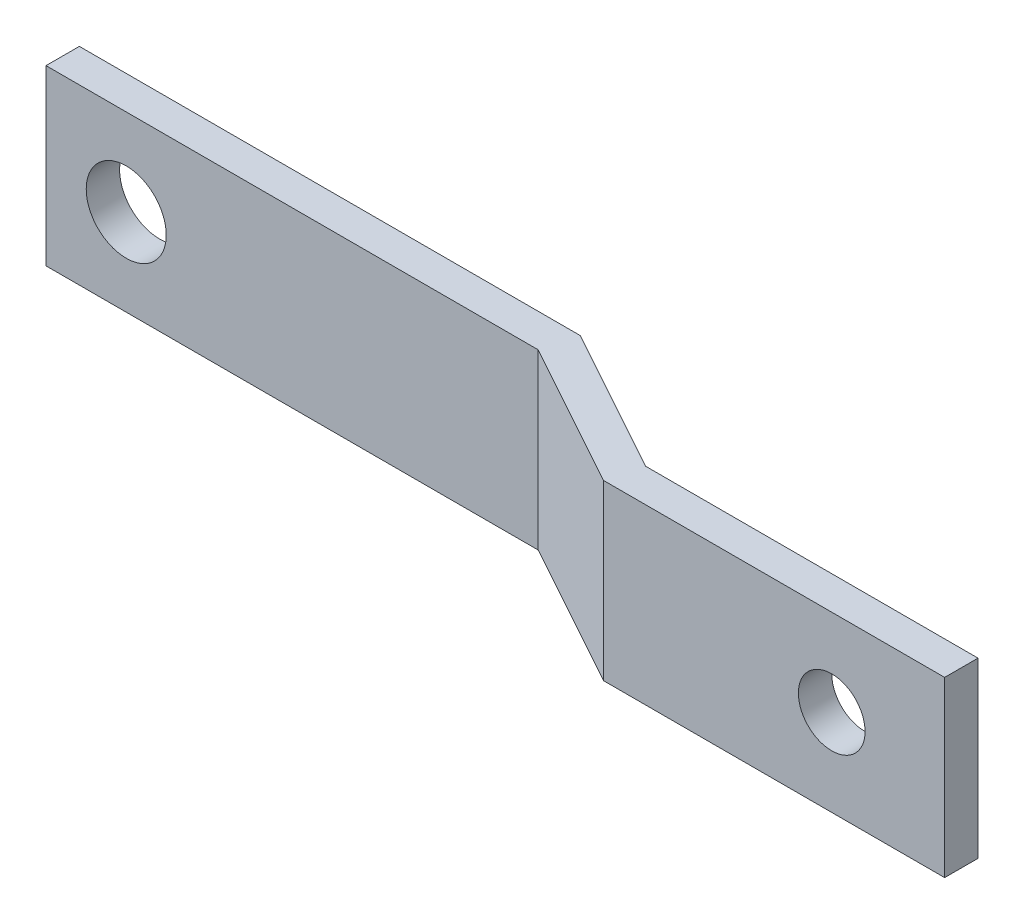
ISO-10303-21;
HEADER;
FILE_DESCRIPTION(('STEP AP214'),'2;1');
FILE_NAME('part.step','',(''),(''),'','','');
FILE_SCHEMA(('AUTOMOTIVE_DESIGN { 1 0 10303 214 1 1 1 1 }'));
ENDSEC;
DATA;
#1=APPLICATION_CONTEXT('core data for automotive mechanical design processes');
#2=APPLICATION_PROTOCOL_DEFINITION('international standard','automotive_design',2000,#1);
#3=PRODUCT_CONTEXT('',#1,'mechanical');
#4=PRODUCT('Part','Part','',(#3));
#5=PRODUCT_RELATED_PRODUCT_CATEGORY('part','',(#4));
#6=PRODUCT_DEFINITION_FORMATION('','',#4);
#7=PRODUCT_DEFINITION_CONTEXT('part definition',#1,'design');
#8=PRODUCT_DEFINITION('design','',#6,#7);
#9=PRODUCT_DEFINITION_SHAPE('','',#8);
#10=(LENGTH_UNIT() NAMED_UNIT(*) SI_UNIT(.MILLI.,.METRE.));
#11=(NAMED_UNIT(*) PLANE_ANGLE_UNIT() SI_UNIT($,.RADIAN.));
#12=(NAMED_UNIT(*) SI_UNIT($,.STERADIAN.) SOLID_ANGLE_UNIT());
#13=UNCERTAINTY_MEASURE_WITH_UNIT(LENGTH_MEASURE(1.E-05),#10,'distance_accuracy_value','');
#14=(GEOMETRIC_REPRESENTATION_CONTEXT(3) GLOBAL_UNCERTAINTY_ASSIGNED_CONTEXT((#13)) GLOBAL_UNIT_ASSIGNED_CONTEXT((#10,
#11,#12)) REPRESENTATION_CONTEXT('',''));
#15=CARTESIAN_POINT('',(0.,0.,0.));
#16=DIRECTION('',(0.,0.,1.));
#17=DIRECTION('',(1.,0.,0.));
#18=AXIS2_PLACEMENT_3D('',#15,#16,#17);
#19=CARTESIAN_POINT('',(49.2452703940796,13.208,8.66886869750178));
#20=DIRECTION('',(0.,0.,-1.));
#21=DIRECTION('',(-1.,0.,0.));
#22=AXIS2_PLACEMENT_3D('',#19,#20,#21);
#23=PLANE('',#22);
#24=CARTESIAN_POINT('',(65.9663861274826,6.604,8.66886869750178));
#25=DIRECTION('',(0.,0.,1.));
#26=DIRECTION('',(1.,0.,0.));
#27=AXIS2_PLACEMENT_3D('',#24,#25,#26);
#28=CIRCLE('',#27,2.54);
#29=CARTESIAN_POINT('',(68.5063861274826,6.604,8.66886869750178));
#30=VERTEX_POINT('',#29);
#31=EDGE_CURVE('E214',#30,#30,#28,.T.);
#32=ORIENTED_EDGE('',*,*,#31,.F.);
#33=EDGE_LOOP('',(#32));
#34=FACE_BOUND('',#33,.T.);
#35=DIRECTION('',(1.,0.,0.));
#36=VECTOR('',#35,1.);
#37=CARTESIAN_POINT('',(49.2452703940796,0.,8.66886869750178));
#38=LINE('',#37,#36);
#39=CARTESIAN_POINT('',(48.5909413517748,0.,8.66886869750178));
#40=VERTEX_POINT('',#39);
#41=CARTESIAN_POINT('',(74.5674344132872,0.,8.66886869750178));
#42=VERTEX_POINT('',#41);
#43=EDGE_CURVE('E141',#40,#42,#38,.T.);
#44=ORIENTED_EDGE('',*,*,#43,.T.);
#45=DIRECTION('',(0.,-1.,0.));
#46=VECTOR('',#45,1.);
#47=CARTESIAN_POINT('',(74.5674344132872,13.208,8.66886869750178));
#48=LINE('',#47,#46);
#49=CARTESIAN_POINT('',(74.5674344132872,13.208,8.66886869750178));
#50=VERTEX_POINT('',#49);
#51=EDGE_CURVE('E11',#50,#42,#48,.T.);
#52=ORIENTED_EDGE('',*,*,#51,.F.);
#53=DIRECTION('',(1.,0.,0.));
#54=VECTOR('',#53,1.);
#55=CARTESIAN_POINT('',(49.2452703940796,13.208,8.66886869750178));
#56=LINE('',#55,#54);
#57=CARTESIAN_POINT('',(48.5909413517748,13.208,8.66886869750178));
#58=VERTEX_POINT('',#57);
#59=EDGE_CURVE('E94',#58,#50,#56,.T.);
#60=ORIENTED_EDGE('',*,*,#59,.F.);
#61=DIRECTION('',(0.,-1.,0.));
#62=VECTOR('',#61,1.);
#63=CARTESIAN_POINT('',(48.5909413517748,13.208,8.66886869750178));
#64=LINE('',#63,#62);
#65=EDGE_CURVE('E140',#58,#40,#64,.T.);
#66=ORIENTED_EDGE('',*,*,#65,.T.);
#67=EDGE_LOOP('',(#44,#52,#60,#66));
#68=FACE_BOUND('',#67,.T.);
#69=ADVANCED_FACE('F38',(#34,#68),#23,.F.);
#70=CARTESIAN_POINT('',(74.5674344132872,13.208,6.12886869750177));
#71=DIRECTION('',(1.,0.,0.));
#72=DIRECTION('',(0.,0.,-1.));
#73=AXIS2_PLACEMENT_3D('',#70,#71,#72);
#74=PLANE('',#73);
#75=DIRECTION('',(0.,0.,1.));
#76=VECTOR('',#75,1.);
#77=CARTESIAN_POINT('',(74.5674344132872,0.,6.12886869750177));
#78=LINE('',#77,#76);
#79=CARTESIAN_POINT('',(74.5674344132872,0.,6.12886869750177));
#80=VERTEX_POINT('',#79);
#81=EDGE_CURVE('E145',#80,#42,#78,.T.);
#82=ORIENTED_EDGE('',*,*,#81,.F.);
#83=DIRECTION('',(0.,-1.,0.));
#84=VECTOR('',#83,1.);
#85=CARTESIAN_POINT('',(74.5674344132872,13.208,6.12886869750177));
#86=LINE('',#85,#84);
#87=CARTESIAN_POINT('',(74.5674344132872,13.208,6.12886869750177));
#88=VERTEX_POINT('',#87);
#89=EDGE_CURVE('E47',#88,#80,#86,.T.);
#90=ORIENTED_EDGE('',*,*,#89,.F.);
#91=DIRECTION('',(0.,0.,1.));
#92=VECTOR('',#91,1.);
#93=CARTESIAN_POINT('',(74.5674344132872,13.208,6.12886869750177));
#94=LINE('',#93,#92);
#95=EDGE_CURVE('E198',#88,#50,#94,.T.);
#96=ORIENTED_EDGE('',*,*,#95,.T.);
#97=ORIENTED_EDGE('',*,*,#51,.T.);
#98=EDGE_LOOP('',(#82,#90,#96,#97));
#99=FACE_BOUND('',#98,.T.);
#100=ADVANCED_FACE('F189',(#99),#74,.T.);
#101=CARTESIAN_POINT('',(49.2452703940796,13.208,6.12886869750177));
#102=DIRECTION('',(0.,0.,-1.));
#103=DIRECTION('',(-1.,0.,0.));
#104=AXIS2_PLACEMENT_3D('',#101,#102,#103);
#105=PLANE('',#104);
#106=CARTESIAN_POINT('',(65.9663861274826,6.604,6.12886869750177));
#107=DIRECTION('',(0.,0.,-1.));
#108=DIRECTION('',(-1.,0.,0.));
#109=AXIS2_PLACEMENT_3D('',#106,#107,#108);
#110=CIRCLE('',#109,2.54);
#111=CARTESIAN_POINT('',(63.4263861274826,6.604,6.12886869750177));
#112=VERTEX_POINT('',#111);
#113=EDGE_CURVE('E215',#112,#112,#110,.F.);
#114=ORIENTED_EDGE('',*,*,#113,.T.);
#115=EDGE_LOOP('',(#114));
#116=FACE_BOUND('',#115,.T.);
#117=DIRECTION('',(1.,0.,0.));
#118=VECTOR('',#117,1.);
#119=CARTESIAN_POINT('',(49.2452703940796,0.,6.12886869750177));
#120=LINE('',#119,#118);
#121=CARTESIAN_POINT('',(49.2452703940796,0.,6.12886869750177));
#122=VERTEX_POINT('',#121);
#123=EDGE_CURVE('E150',#122,#80,#120,.T.);
#124=ORIENTED_EDGE('',*,*,#123,.F.);
#125=DIRECTION('',(0.,-1.,0.));
#126=VECTOR('',#125,1.);
#127=CARTESIAN_POINT('',(49.2452703940796,13.208,6.12886869750177));
#128=LINE('',#127,#126);
#129=CARTESIAN_POINT('',(49.2452703940796,13.208,6.12886869750177));
#130=VERTEX_POINT('',#129);
#131=EDGE_CURVE('E177',#130,#122,#128,.T.);
#132=ORIENTED_EDGE('',*,*,#131,.F.);
#133=DIRECTION('',(1.,0.,0.));
#134=VECTOR('',#133,1.);
#135=CARTESIAN_POINT('',(49.2452703940796,13.208,6.12886869750177));
#136=LINE('',#135,#134);
#137=EDGE_CURVE('E186',#130,#88,#136,.T.);
#138=ORIENTED_EDGE('',*,*,#137,.T.);
#139=ORIENTED_EDGE('',*,*,#89,.T.);
#140=EDGE_LOOP('',(#124,#132,#138,#139));
#141=FACE_BOUND('',#140,.T.);
#142=ADVANCED_FACE('F184',(#116,#141),#105,.T.);
#143=CARTESIAN_POINT('',(38.1390581049535,13.208,0.));
#144=DIRECTION('',(0.483156107137484,0.,-0.875534223280708));
#145=DIRECTION('',(-0.875534223280708,0.,-0.483156107137484));
#146=AXIS2_PLACEMENT_3D('',#143,#144,#145);
#147=PLANE('',#146);
#148=DIRECTION('',(0.875534223280708,0.,0.483156107137484));
#149=VECTOR('',#148,1.);
#150=CARTESIAN_POINT('',(38.1390581049535,0.,0.));
#151=LINE('',#150,#149);
#152=CARTESIAN_POINT('',(38.1390581049535,0.,0.));
#153=VERTEX_POINT('',#152);
#154=EDGE_CURVE('E154',#153,#122,#151,.T.);
#155=ORIENTED_EDGE('',*,*,#154,.F.);
#156=DIRECTION('',(0.,-1.,0.));
#157=VECTOR('',#156,1.);
#158=CARTESIAN_POINT('',(38.1390581049535,13.208,0.));
#159=LINE('',#158,#157);
#160=CARTESIAN_POINT('',(38.1390581049535,13.208,0.));
#161=VERTEX_POINT('',#160);
#162=EDGE_CURVE('E174',#161,#153,#159,.T.);
#163=ORIENTED_EDGE('',*,*,#162,.F.);
#164=DIRECTION('',(0.875534223280708,0.,0.483156107137484));
#165=VECTOR('',#164,1.);
#166=CARTESIAN_POINT('',(38.1390581049535,13.208,0.));
#167=LINE('',#166,#165);
#168=EDGE_CURVE('E134',#161,#130,#167,.T.);
#169=ORIENTED_EDGE('',*,*,#168,.T.);
#170=ORIENTED_EDGE('',*,*,#131,.T.);
#171=EDGE_LOOP('',(#155,#163,#169,#170));
#172=FACE_BOUND('',#171,.T.);
#173=ADVANCED_FACE('F196',(#172),#147,.T.);
#174=CARTESIAN_POINT('',(0.,13.208,0.));
#175=DIRECTION('',(0.,0.,-1.));
#176=DIRECTION('',(-1.,0.,0.));
#177=AXIS2_PLACEMENT_3D('',#174,#175,#176);
#178=PLANE('',#177);
#179=CARTESIAN_POINT('',(6.11062579811326,6.604,0.));
#180=DIRECTION('',(0.,0.,-1.));
#181=DIRECTION('',(-1.,0.,0.));
#182=AXIS2_PLACEMENT_3D('',#179,#180,#181);
#183=CIRCLE('',#182,3.048);
#184=CARTESIAN_POINT('',(3.06262579811326,6.604,0.));
#185=VERTEX_POINT('',#184);
#186=EDGE_CURVE('E210',#185,#185,#183,.T.);
#187=ORIENTED_EDGE('',*,*,#186,.F.);
#188=EDGE_LOOP('',(#187));
#189=FACE_BOUND('',#188,.T.);
#190=DIRECTION('',(1.,0.,0.));
#191=VECTOR('',#190,1.);
#192=CARTESIAN_POINT('',(0.,0.,0.));
#193=LINE('',#192,#191);
#194=CARTESIAN_POINT('',(0.,0.,0.));
#195=VERTEX_POINT('',#194);
#196=EDGE_CURVE('E158',#195,#153,#193,.T.);
#197=ORIENTED_EDGE('',*,*,#196,.F.);
#198=DIRECTION('',(0.,-1.,0.));
#199=VECTOR('',#198,1.);
#200=CARTESIAN_POINT('',(0.,13.208,0.));
#201=LINE('',#200,#199);
#202=CARTESIAN_POINT('',(0.,13.208,0.));
#203=VERTEX_POINT('',#202);
#204=EDGE_CURVE('E119',#203,#195,#201,.T.);
#205=ORIENTED_EDGE('',*,*,#204,.F.);
#206=DIRECTION('',(1.,0.,0.));
#207=VECTOR('',#206,1.);
#208=CARTESIAN_POINT('',(0.,13.208,0.));
#209=LINE('',#208,#207);
#210=EDGE_CURVE('E130',#203,#161,#209,.T.);
#211=ORIENTED_EDGE('',*,*,#210,.T.);
#212=ORIENTED_EDGE('',*,*,#162,.T.);
#213=EDGE_LOOP('',(#197,#205,#211,#212));
#214=FACE_BOUND('',#213,.T.);
#215=ADVANCED_FACE('F242',(#189,#214),#178,.T.);
#216=CARTESIAN_POINT('',(0.,13.208,2.54));
#217=DIRECTION('',(-1.,0.,0.));
#218=DIRECTION('',(0.,0.,1.));
#219=AXIS2_PLACEMENT_3D('',#216,#217,#218);
#220=PLANE('',#219);
#221=DIRECTION('',(0.,0.,-1.));
#222=VECTOR('',#221,1.);
#223=CARTESIAN_POINT('',(0.,0.,2.54));
#224=LINE('',#223,#222);
#225=CARTESIAN_POINT('',(0.,0.,2.54));
#226=VERTEX_POINT('',#225);
#227=EDGE_CURVE('E117',#226,#195,#224,.T.);
#228=ORIENTED_EDGE('',*,*,#227,.F.);
#229=DIRECTION('',(0.,-1.,0.));
#230=VECTOR('',#229,1.);
#231=CARTESIAN_POINT('',(0.,13.208,2.54));
#232=LINE('',#231,#230);
#233=CARTESIAN_POINT('',(0.,13.208,2.54));
#234=VERTEX_POINT('',#233);
#235=EDGE_CURVE('E111',#234,#226,#232,.T.);
#236=ORIENTED_EDGE('',*,*,#235,.F.);
#237=DIRECTION('',(0.,0.,-1.));
#238=VECTOR('',#237,1.);
#239=CARTESIAN_POINT('',(0.,13.208,2.54));
#240=LINE('',#239,#238);
#241=EDGE_CURVE('E115',#234,#203,#240,.T.);
#242=ORIENTED_EDGE('',*,*,#241,.T.);
#243=ORIENTED_EDGE('',*,*,#204,.T.);
#244=EDGE_LOOP('',(#228,#236,#242,#243));
#245=FACE_BOUND('',#244,.T.);
#246=ADVANCED_FACE('F113',(#245),#220,.T.);
#247=CARTESIAN_POINT('',(0.,13.208,2.54));
#248=DIRECTION('',(0.,0.,-1.));
#249=DIRECTION('',(-1.,0.,0.));
#250=AXIS2_PLACEMENT_3D('',#247,#248,#249);
#251=PLANE('',#250);
#252=CARTESIAN_POINT('',(6.11062579811326,6.604,2.54));
#253=DIRECTION('',(0.,0.,-1.));
#254=DIRECTION('',(-1.,0.,0.));
#255=AXIS2_PLACEMENT_3D('',#252,#253,#254);
#256=CIRCLE('',#255,3.048);
#257=CARTESIAN_POINT('',(3.06262579811326,6.604,2.54));
#258=VERTEX_POINT('',#257);
#259=EDGE_CURVE('E146',#258,#258,#256,.F.);
#260=ORIENTED_EDGE('',*,*,#259,.F.);
#261=EDGE_LOOP('',(#260));
#262=FACE_BOUND('',#261,.T.);
#263=DIRECTION('',(1.,0.,0.));
#264=VECTOR('',#263,1.);
#265=CARTESIAN_POINT('',(0.,0.,2.54));
#266=LINE('',#265,#264);
#267=CARTESIAN_POINT('',(37.4847290626487,0.,2.54));
#268=VERTEX_POINT('',#267);
#269=EDGE_CURVE('E82',#226,#268,#266,.T.);
#270=ORIENTED_EDGE('',*,*,#269,.T.);
#271=DIRECTION('',(0.,-1.,0.));
#272=VECTOR('',#271,1.);
#273=CARTESIAN_POINT('',(37.4847290626487,13.208,2.54));
#274=LINE('',#273,#272);
#275=CARTESIAN_POINT('',(37.4847290626487,13.208,2.54));
#276=VERTEX_POINT('',#275);
#277=EDGE_CURVE('E120',#276,#268,#274,.T.);
#278=ORIENTED_EDGE('',*,*,#277,.F.);
#279=DIRECTION('',(1.,0.,0.));
#280=VECTOR('',#279,1.);
#281=CARTESIAN_POINT('',(0.,13.208,2.54));
#282=LINE('',#281,#280);
#283=EDGE_CURVE('E122',#234,#276,#282,.T.);
#284=ORIENTED_EDGE('',*,*,#283,.F.);
#285=ORIENTED_EDGE('',*,*,#235,.T.);
#286=EDGE_LOOP('',(#270,#278,#284,#285));
#287=FACE_BOUND('',#286,.T.);
#288=ADVANCED_FACE('F123',(#262,#287),#251,.F.);
#289=CARTESIAN_POINT('',(36.9118415928243,13.208,2.223856927133));
#290=DIRECTION('',(0.483156107137484,0.,-0.875534223280708));
#291=DIRECTION('',(-0.875534223280708,0.,-0.483156107137484));
#292=AXIS2_PLACEMENT_3D('',#289,#290,#291);
#293=PLANE('',#292);
#294=DIRECTION('',(0.875534223280708,0.,0.483156107137484));
#295=VECTOR('',#294,1.);
#296=CARTESIAN_POINT('',(36.9118415928243,0.,2.223856927133));
#297=LINE('',#296,#295);
#298=EDGE_CURVE('E88',#268,#40,#297,.T.);
#299=ORIENTED_EDGE('',*,*,#298,.T.);
#300=ORIENTED_EDGE('',*,*,#65,.F.);
#301=DIRECTION('',(0.875534223280708,0.,0.483156107137484));
#302=VECTOR('',#301,1.);
#303=CARTESIAN_POINT('',(36.9118415928243,13.208,2.223856927133));
#304=LINE('',#303,#302);
#305=EDGE_CURVE('E55',#276,#58,#304,.T.);
#306=ORIENTED_EDGE('',*,*,#305,.F.);
#307=ORIENTED_EDGE('',*,*,#277,.T.);
#308=EDGE_LOOP('',(#299,#300,#306,#307));
#309=FACE_BOUND('',#308,.T.);
#310=ADVANCED_FACE('F227',(#309),#293,.F.);
#311=CARTESIAN_POINT('',(0.,13.208,0.));
#312=DIRECTION('',(0.,-1.,0.));
#313=DIRECTION('',(-1.,0.,0.));
#314=AXIS2_PLACEMENT_3D('',#311,#312,#313);
#315=PLANE('',#314);
#316=ORIENTED_EDGE('',*,*,#59,.T.);
#317=ORIENTED_EDGE('',*,*,#95,.F.);
#318=ORIENTED_EDGE('',*,*,#137,.F.);
#319=ORIENTED_EDGE('',*,*,#168,.F.);
#320=ORIENTED_EDGE('',*,*,#210,.F.);
#321=ORIENTED_EDGE('',*,*,#241,.F.);
#322=ORIENTED_EDGE('',*,*,#283,.T.);
#323=ORIENTED_EDGE('',*,*,#305,.T.);
#324=EDGE_LOOP('',(#316,#317,#318,#319,#320,#321,#322,#323));
#325=FACE_BOUND('',#324,.T.);
#326=ADVANCED_FACE('F127',(#325),#315,.F.);
#327=CARTESIAN_POINT('',(0.,0.,0.));
#328=DIRECTION('',(0.,-1.,0.));
#329=DIRECTION('',(-1.,0.,0.));
#330=AXIS2_PLACEMENT_3D('',#327,#328,#329);
#331=PLANE('',#330);
#332=ORIENTED_EDGE('',*,*,#43,.F.);
#333=ORIENTED_EDGE('',*,*,#298,.F.);
#334=ORIENTED_EDGE('',*,*,#269,.F.);
#335=ORIENTED_EDGE('',*,*,#227,.T.);
#336=ORIENTED_EDGE('',*,*,#196,.T.);
#337=ORIENTED_EDGE('',*,*,#154,.T.);
#338=ORIENTED_EDGE('',*,*,#123,.T.);
#339=ORIENTED_EDGE('',*,*,#81,.T.);
#340=EDGE_LOOP('',(#332,#333,#334,#335,#336,#337,#338,#339));
#341=FACE_BOUND('',#340,.T.);
#342=ADVANCED_FACE('F192',(#341),#331,.T.);
#343=CARTESIAN_POINT('',(6.11062579811326,6.604,8.66986869750177));
#344=DIRECTION('',(0.,0.,-1.));
#345=DIRECTION('',(-1.,0.,0.));
#346=AXIS2_PLACEMENT_3D('',#343,#344,#345);
#347=CYLINDRICAL_SURFACE('',#346,3.048);
#348=ORIENTED_EDGE('',*,*,#186,.T.);
#349=EDGE_LOOP('',(#348));
#350=FACE_BOUND('',#349,.T.);
#351=ORIENTED_EDGE('',*,*,#259,.T.);
#352=EDGE_LOOP('',(#351));
#353=FACE_BOUND('',#352,.T.);
#354=ADVANCED_FACE('F287',(#350,#353),#347,.F.);
#355=CARTESIAN_POINT('',(65.9663861274826,6.604,-0.000999999999999265));
#356=DIRECTION('',(0.,0.,1.));
#357=DIRECTION('',(1.,0.,0.));
#358=AXIS2_PLACEMENT_3D('',#355,#356,#357);
#359=CYLINDRICAL_SURFACE('',#358,2.54);
#360=ORIENTED_EDGE('',*,*,#113,.F.);
#361=EDGE_LOOP('',(#360));
#362=FACE_BOUND('',#361,.T.);
#363=ORIENTED_EDGE('',*,*,#31,.T.);
#364=EDGE_LOOP('',(#363));
#365=FACE_BOUND('',#364,.T.);
#366=ADVANCED_FACE('F223',(#362,#365),#359,.F.);
#367=CLOSED_SHELL('',(#69,#100,#142,#173,#215,#246,#288,#310,#326,#342,#354,#366));
#368=MANIFOLD_SOLID_BREP('B2',#367);
#369=ADVANCED_BREP_SHAPE_REPRESENTATION('',(#18,#368),#14);
#370=SHAPE_DEFINITION_REPRESENTATION(#9,#369);
ENDSEC;
END-ISO-10303-21;
